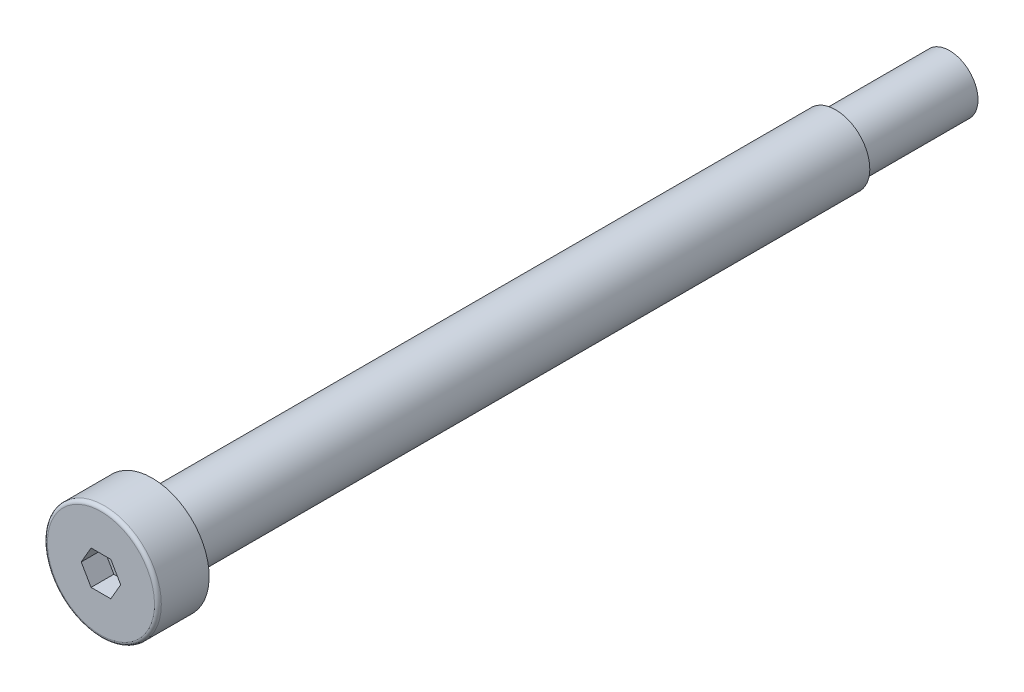
ISO-10303-21;
HEADER;
FILE_DESCRIPTION(('STEP AP214'),'2;1');
FILE_NAME('part.step','',(''),(''),'','','');
FILE_SCHEMA(('AUTOMOTIVE_DESIGN { 1 0 10303 214 1 1 1 1 }'));
ENDSEC;
DATA;
#1=APPLICATION_CONTEXT('core data for automotive mechanical design processes');
#2=APPLICATION_PROTOCOL_DEFINITION('international standard','automotive_design',2000,#1);
#3=PRODUCT_CONTEXT('',#1,'mechanical');
#4=PRODUCT('Part','Part','',(#3));
#5=PRODUCT_RELATED_PRODUCT_CATEGORY('part','',(#4));
#6=PRODUCT_DEFINITION_FORMATION('','',#4);
#7=PRODUCT_DEFINITION_CONTEXT('part definition',#1,'design');
#8=PRODUCT_DEFINITION('design','',#6,#7);
#9=PRODUCT_DEFINITION_SHAPE('','',#8);
#10=(LENGTH_UNIT() NAMED_UNIT(*) SI_UNIT(.MILLI.,.METRE.));
#11=(NAMED_UNIT(*) PLANE_ANGLE_UNIT() SI_UNIT($,.RADIAN.));
#12=(NAMED_UNIT(*) SI_UNIT($,.STERADIAN.) SOLID_ANGLE_UNIT());
#13=UNCERTAINTY_MEASURE_WITH_UNIT(LENGTH_MEASURE(1.E-05),#10,'distance_accuracy_value','');
#14=(GEOMETRIC_REPRESENTATION_CONTEXT(3) GLOBAL_UNCERTAINTY_ASSIGNED_CONTEXT((#13)) GLOBAL_UNIT_ASSIGNED_CONTEXT((#10,
#11,#12)) REPRESENTATION_CONTEXT('',''));
#15=CARTESIAN_POINT('',(0.,0.,0.));
#16=DIRECTION('',(0.,0.,1.));
#17=DIRECTION('',(1.,0.,0.));
#18=AXIS2_PLACEMENT_3D('',#15,#16,#17);
#19=CARTESIAN_POINT('',(0.,0.,0.));
#20=DIRECTION('',(0.,0.,1.));
#21=DIRECTION('',(0.,-1.,0.));
#22=AXIS2_PLACEMENT_3D('',#19,#20,#21);
#23=PLANE('',#22);
#24=CARTESIAN_POINT('',(0.,0.,0.));
#25=DIRECTION('',(0.,0.,1.));
#26=DIRECTION('',(0.,-1.,0.));
#27=AXIS2_PLACEMENT_3D('',#24,#25,#26);
#28=CIRCLE('',#27,4.7);
#29=CARTESIAN_POINT('',(0.,-4.7,0.));
#30=VERTEX_POINT('',#29);
#31=EDGE_CURVE('E11',#30,#30,#28,.T.);
#32=ORIENTED_EDGE('',*,*,#31,.T.);
#33=EDGE_LOOP('',(#32));
#34=FACE_BOUND('',#33,.T.);
#35=DIRECTION('',(-0.5,0.866025403784438,0.));
#36=VECTOR('',#35,1.);
#37=CARTESIAN_POINT('',(1.73205080756888,0.,0.));
#38=LINE('',#37,#36);
#39=CARTESIAN_POINT('',(1.73205080756888,0.,0.));
#40=VERTEX_POINT('',#39);
#41=CARTESIAN_POINT('',(0.866025403784439,1.5,0.));
#42=VERTEX_POINT('',#41);
#43=EDGE_CURVE('E51',#40,#42,#38,.T.);
#44=ORIENTED_EDGE('',*,*,#43,.F.);
#45=DIRECTION('',(0.5,0.866025403784439,0.));
#46=VECTOR('',#45,1.);
#47=CARTESIAN_POINT('',(0.866025403784438,-1.5,0.));
#48=LINE('',#47,#46);
#49=CARTESIAN_POINT('',(0.866025403784438,-1.5,0.));
#50=VERTEX_POINT('',#49);
#51=EDGE_CURVE('E134',#50,#40,#48,.T.);
#52=ORIENTED_EDGE('',*,*,#51,.F.);
#53=DIRECTION('',(1.,0.,0.));
#54=VECTOR('',#53,1.);
#55=CARTESIAN_POINT('',(-0.866025403784438,-1.5,0.));
#56=LINE('',#55,#54);
#57=CARTESIAN_POINT('',(-0.866025403784438,-1.5,0.));
#58=VERTEX_POINT('',#57);
#59=EDGE_CURVE('E132',#58,#50,#56,.T.);
#60=ORIENTED_EDGE('',*,*,#59,.F.);
#61=DIRECTION('',(0.5,-0.866025403784438,0.));
#62=VECTOR('',#61,1.);
#63=CARTESIAN_POINT('',(-1.73205080756888,0.,0.));
#64=LINE('',#63,#62);
#65=CARTESIAN_POINT('',(-1.73205080756888,0.,0.));
#66=VERTEX_POINT('',#65);
#67=EDGE_CURVE('E99',#66,#58,#64,.T.);
#68=ORIENTED_EDGE('',*,*,#67,.F.);
#69=DIRECTION('',(-0.5,-0.866025403784438,0.));
#70=VECTOR('',#69,1.);
#71=CARTESIAN_POINT('',(-0.866025403784439,1.5,0.));
#72=LINE('',#71,#70);
#73=CARTESIAN_POINT('',(-0.866025403784439,1.5,0.));
#74=VERTEX_POINT('',#73);
#75=EDGE_CURVE('E128',#74,#66,#72,.T.);
#76=ORIENTED_EDGE('',*,*,#75,.F.);
#77=DIRECTION('',(-1.,0.,0.));
#78=VECTOR('',#77,1.);
#79=CARTESIAN_POINT('',(0.866025403784439,1.5,0.));
#80=LINE('',#79,#78);
#81=EDGE_CURVE('E125',#42,#74,#80,.T.);
#82=ORIENTED_EDGE('',*,*,#81,.F.);
#83=EDGE_LOOP('',(#44,#52,#60,#68,#76,#82));
#84=FACE_BOUND('',#83,.T.);
#85=ADVANCED_FACE('F36',(#34,#84),#23,.T.);
#86=CARTESIAN_POINT('',(0.,0.,-74.5));
#87=DIRECTION('',(0.,0.,-1.));
#88=DIRECTION('',(0.,1.,0.));
#89=AXIS2_PLACEMENT_3D('',#86,#87,#88);
#90=CYLINDRICAL_SURFACE('',#89,5.);
#91=CARTESIAN_POINT('',(0.,0.,-0.299999999999995));
#92=DIRECTION('',(0.,0.,1.));
#93=DIRECTION('',(0.,-1.,0.));
#94=AXIS2_PLACEMENT_3D('',#91,#92,#93);
#95=CIRCLE('',#94,5.);
#96=CARTESIAN_POINT('',(0.,-5.,-0.299999999999996));
#97=VERTEX_POINT('',#96);
#98=EDGE_CURVE('E44',#97,#97,#95,.F.);
#99=ORIENTED_EDGE('',*,*,#98,.T.);
#100=EDGE_LOOP('',(#99));
#101=FACE_BOUND('',#100,.T.);
#102=CARTESIAN_POINT('',(0.,0.,-4.5));
#103=DIRECTION('',(0.,0.,-1.));
#104=DIRECTION('',(0.,1.,0.));
#105=AXIS2_PLACEMENT_3D('',#102,#103,#104);
#106=CIRCLE('',#105,5.);
#107=CARTESIAN_POINT('',(0.,5.,-4.5));
#108=VERTEX_POINT('',#107);
#109=EDGE_CURVE('E155',#108,#108,#106,.T.);
#110=ORIENTED_EDGE('',*,*,#109,.F.);
#111=EDGE_LOOP('',(#110));
#112=FACE_BOUND('',#111,.T.);
#113=ADVANCED_FACE('F160',(#101,#112),#90,.T.);
#114=CARTESIAN_POINT('',(0.,5.,-4.5));
#115=DIRECTION('',(0.,0.,-1.));
#116=DIRECTION('',(0.,1.,0.));
#117=AXIS2_PLACEMENT_3D('',#114,#115,#116);
#118=PLANE('',#117);
#119=ORIENTED_EDGE('',*,*,#109,.T.);
#120=EDGE_LOOP('',(#119));
#121=FACE_BOUND('',#120,.T.);
#122=CARTESIAN_POINT('',(0.,0.,-4.5));
#123=DIRECTION('',(0.,0.,-1.));
#124=DIRECTION('',(0.,1.,0.));
#125=AXIS2_PLACEMENT_3D('',#122,#123,#124);
#126=CIRCLE('',#125,3.);
#127=CARTESIAN_POINT('',(0.,3.,-4.5));
#128=VERTEX_POINT('',#127);
#129=EDGE_CURVE('E152',#128,#128,#126,.T.);
#130=ORIENTED_EDGE('',*,*,#129,.F.);
#131=EDGE_LOOP('',(#130));
#132=FACE_BOUND('',#131,.T.);
#133=ADVANCED_FACE('F176',(#121,#132),#118,.T.);
#134=CARTESIAN_POINT('',(0.,0.,-74.5));
#135=DIRECTION('',(0.,0.,-1.));
#136=DIRECTION('',(0.,1.,0.));
#137=AXIS2_PLACEMENT_3D('',#134,#135,#136);
#138=CYLINDRICAL_SURFACE('',#137,2.99999999999999);
#139=ORIENTED_EDGE('',*,*,#129,.T.);
#140=EDGE_LOOP('',(#139));
#141=FACE_BOUND('',#140,.T.);
#142=CARTESIAN_POINT('',(0.,0.,-64.5));
#143=DIRECTION('',(0.,0.,-1.));
#144=DIRECTION('',(0.,1.,0.));
#145=AXIS2_PLACEMENT_3D('',#142,#143,#144);
#146=CIRCLE('',#145,2.99999999999998);
#147=CARTESIAN_POINT('',(0.,3.,-64.5));
#148=VERTEX_POINT('',#147);
#149=EDGE_CURVE('E149',#148,#148,#146,.T.);
#150=ORIENTED_EDGE('',*,*,#149,.F.);
#151=EDGE_LOOP('',(#150));
#152=FACE_BOUND('',#151,.T.);
#153=ADVANCED_FACE('F182',(#141,#152),#138,.T.);
#154=CARTESIAN_POINT('',(0.,3.,-64.5));
#155=DIRECTION('',(0.,0.,-1.));
#156=DIRECTION('',(0.,1.,0.));
#157=AXIS2_PLACEMENT_3D('',#154,#155,#156);
#158=PLANE('',#157);
#159=ORIENTED_EDGE('',*,*,#149,.T.);
#160=EDGE_LOOP('',(#159));
#161=FACE_BOUND('',#160,.T.);
#162=CARTESIAN_POINT('',(0.,0.,-64.5));
#163=DIRECTION('',(0.,0.,-1.));
#164=DIRECTION('',(0.,1.,0.));
#165=AXIS2_PLACEMENT_3D('',#162,#163,#164);
#166=CIRCLE('',#165,2.49999999999999);
#167=CARTESIAN_POINT('',(0.,2.5,-64.5));
#168=VERTEX_POINT('',#167);
#169=EDGE_CURVE('E146',#168,#168,#166,.T.);
#170=ORIENTED_EDGE('',*,*,#169,.F.);
#171=EDGE_LOOP('',(#170));
#172=FACE_BOUND('',#171,.T.);
#173=ADVANCED_FACE('F186',(#161,#172),#158,.T.);
#174=CARTESIAN_POINT('',(0.,0.,-74.5));
#175=DIRECTION('',(0.,0.,-1.));
#176=DIRECTION('',(0.,1.,0.));
#177=AXIS2_PLACEMENT_3D('',#174,#175,#176);
#178=CYLINDRICAL_SURFACE('',#177,2.49999999999998);
#179=ORIENTED_EDGE('',*,*,#169,.T.);
#180=EDGE_LOOP('',(#179));
#181=FACE_BOUND('',#180,.T.);
#182=CARTESIAN_POINT('',(0.,0.,-74.5));
#183=DIRECTION('',(0.,0.,-1.));
#184=DIRECTION('',(0.,1.,0.));
#185=AXIS2_PLACEMENT_3D('',#182,#183,#184);
#186=CIRCLE('',#185,2.49999999999998);
#187=CARTESIAN_POINT('',(0.,2.5,-74.5));
#188=VERTEX_POINT('',#187);
#189=EDGE_CURVE('E138',#188,#188,#186,.T.);
#190=ORIENTED_EDGE('',*,*,#189,.F.);
#191=EDGE_LOOP('',(#190));
#192=FACE_BOUND('',#191,.T.);
#193=ADVANCED_FACE('F190',(#181,#192),#178,.T.);
#194=CARTESIAN_POINT('',(0.,2.5,-74.5));
#195=DIRECTION('',(0.,0.,-1.));
#196=DIRECTION('',(0.,1.,0.));
#197=AXIS2_PLACEMENT_3D('',#194,#195,#196);
#198=PLANE('',#197);
#199=ORIENTED_EDGE('',*,*,#189,.T.);
#200=EDGE_LOOP('',(#199));
#201=FACE_BOUND('',#200,.T.);
#202=ADVANCED_FACE('F194',(#201),#198,.T.);
#203=CARTESIAN_POINT('',(1.73205080756888,0.,-2.));
#204=DIRECTION('',(0.866025403784438,0.5,0.));
#205=DIRECTION('',(-0.5,0.866025403784439,0.));
#206=AXIS2_PLACEMENT_3D('',#203,#204,#205);
#207=PLANE('',#206);
#208=ORIENTED_EDGE('',*,*,#43,.T.);
#209=DIRECTION('',(0.,0.,1.));
#210=VECTOR('',#209,1.);
#211=CARTESIAN_POINT('',(0.866025403784439,1.5,-2.));
#212=LINE('',#211,#210);
#213=CARTESIAN_POINT('',(0.866025403784439,1.5,-2.));
#214=VERTEX_POINT('',#213);
#215=EDGE_CURVE('E81',#214,#42,#212,.T.);
#216=ORIENTED_EDGE('',*,*,#215,.F.);
#217=DIRECTION('',(-0.5,0.866025403784438,0.));
#218=VECTOR('',#217,1.);
#219=CARTESIAN_POINT('',(1.73205080756888,0.,-2.));
#220=LINE('',#219,#218);
#221=CARTESIAN_POINT('',(1.73205080756888,0.,-2.));
#222=VERTEX_POINT('',#221);
#223=EDGE_CURVE('E136',#222,#214,#220,.T.);
#224=ORIENTED_EDGE('',*,*,#223,.F.);
#225=DIRECTION('',(0.,0.,1.));
#226=VECTOR('',#225,1.);
#227=CARTESIAN_POINT('',(1.73205080756888,0.,-2.));
#228=LINE('',#227,#226);
#229=EDGE_CURVE('E59',#222,#40,#228,.T.);
#230=ORIENTED_EDGE('',*,*,#229,.T.);
#231=EDGE_LOOP('',(#208,#216,#224,#230));
#232=FACE_BOUND('',#231,.T.);
#233=ADVANCED_FACE('F198',(#232),#207,.F.);
#234=CARTESIAN_POINT('',(0.866025403784438,-1.5,-2.));
#235=DIRECTION('',(0.866025403784439,-0.5,0.));
#236=DIRECTION('',(0.5,0.866025403784439,0.));
#237=AXIS2_PLACEMENT_3D('',#234,#235,#236);
#238=PLANE('',#237);
#239=ORIENTED_EDGE('',*,*,#51,.T.);
#240=ORIENTED_EDGE('',*,*,#229,.F.);
#241=DIRECTION('',(0.5,0.866025403784439,0.));
#242=VECTOR('',#241,1.);
#243=CARTESIAN_POINT('',(0.866025403784438,-1.5,-2.));
#244=LINE('',#243,#242);
#245=CARTESIAN_POINT('',(0.866025403784438,-1.5,-2.));
#246=VERTEX_POINT('',#245);
#247=EDGE_CURVE('E111',#246,#222,#244,.T.);
#248=ORIENTED_EDGE('',*,*,#247,.F.);
#249=DIRECTION('',(0.,0.,1.));
#250=VECTOR('',#249,1.);
#251=CARTESIAN_POINT('',(0.866025403784438,-1.5,-2.));
#252=LINE('',#251,#250);
#253=EDGE_CURVE('E103',#246,#50,#252,.T.);
#254=ORIENTED_EDGE('',*,*,#253,.T.);
#255=EDGE_LOOP('',(#239,#240,#248,#254));
#256=FACE_BOUND('',#255,.T.);
#257=ADVANCED_FACE('F202',(#256),#238,.F.);
#258=CARTESIAN_POINT('',(-0.866025403784438,-1.5,-2.));
#259=DIRECTION('',(0.,-1.,0.));
#260=DIRECTION('',(0.,0.,-1.));
#261=AXIS2_PLACEMENT_3D('',#258,#259,#260);
#262=PLANE('',#261);
#263=ORIENTED_EDGE('',*,*,#59,.T.);
#264=ORIENTED_EDGE('',*,*,#253,.F.);
#265=DIRECTION('',(1.,0.,0.));
#266=VECTOR('',#265,1.);
#267=CARTESIAN_POINT('',(-0.866025403784438,-1.5,-2.));
#268=LINE('',#267,#266);
#269=CARTESIAN_POINT('',(-0.866025403784438,-1.5,-2.));
#270=VERTEX_POINT('',#269);
#271=EDGE_CURVE('E107',#270,#246,#268,.T.);
#272=ORIENTED_EDGE('',*,*,#271,.F.);
#273=DIRECTION('',(0.,0.,1.));
#274=VECTOR('',#273,1.);
#275=CARTESIAN_POINT('',(-0.866025403784438,-1.5,-2.));
#276=LINE('',#275,#274);
#277=EDGE_CURVE('E92',#270,#58,#276,.T.);
#278=ORIENTED_EDGE('',*,*,#277,.T.);
#279=EDGE_LOOP('',(#263,#264,#272,#278));
#280=FACE_BOUND('',#279,.T.);
#281=ADVANCED_FACE('F108',(#280),#262,.F.);
#282=CARTESIAN_POINT('',(-1.73205080756888,0.,-2.));
#283=DIRECTION('',(-0.866025403784438,-0.5,0.));
#284=DIRECTION('',(0.5,-0.866025403784439,0.));
#285=AXIS2_PLACEMENT_3D('',#282,#283,#284);
#286=PLANE('',#285);
#287=ORIENTED_EDGE('',*,*,#67,.T.);
#288=ORIENTED_EDGE('',*,*,#277,.F.);
#289=DIRECTION('',(0.5,-0.866025403784438,0.));
#290=VECTOR('',#289,1.);
#291=CARTESIAN_POINT('',(-1.73205080756888,0.,-2.));
#292=LINE('',#291,#290);
#293=CARTESIAN_POINT('',(-1.73205080756888,0.,-2.));
#294=VERTEX_POINT('',#293);
#295=EDGE_CURVE('E96',#294,#270,#292,.T.);
#296=ORIENTED_EDGE('',*,*,#295,.F.);
#297=DIRECTION('',(0.,0.,1.));
#298=VECTOR('',#297,1.);
#299=CARTESIAN_POINT('',(-1.73205080756888,0.,-2.));
#300=LINE('',#299,#298);
#301=EDGE_CURVE('E104',#294,#66,#300,.T.);
#302=ORIENTED_EDGE('',*,*,#301,.T.);
#303=EDGE_LOOP('',(#287,#288,#296,#302));
#304=FACE_BOUND('',#303,.T.);
#305=ADVANCED_FACE('F94',(#304),#286,.F.);
#306=CARTESIAN_POINT('',(-0.866025403784439,1.5,-2.));
#307=DIRECTION('',(-0.866025403784439,0.5,0.));
#308=DIRECTION('',(-0.5,-0.866025403784438,0.));
#309=AXIS2_PLACEMENT_3D('',#306,#307,#308);
#310=PLANE('',#309);
#311=ORIENTED_EDGE('',*,*,#75,.T.);
#312=ORIENTED_EDGE('',*,*,#301,.F.);
#313=DIRECTION('',(-0.5,-0.866025403784438,0.));
#314=VECTOR('',#313,1.);
#315=CARTESIAN_POINT('',(-0.866025403784439,1.5,-2.));
#316=LINE('',#315,#314);
#317=CARTESIAN_POINT('',(-0.866025403784439,1.5,-2.));
#318=VERTEX_POINT('',#317);
#319=EDGE_CURVE('E117',#318,#294,#316,.T.);
#320=ORIENTED_EDGE('',*,*,#319,.F.);
#321=DIRECTION('',(0.,0.,1.));
#322=VECTOR('',#321,1.);
#323=CARTESIAN_POINT('',(-0.866025403784439,1.5,-2.));
#324=LINE('',#323,#322);
#325=EDGE_CURVE('E141',#318,#74,#324,.T.);
#326=ORIENTED_EDGE('',*,*,#325,.T.);
#327=EDGE_LOOP('',(#311,#312,#320,#326));
#328=FACE_BOUND('',#327,.T.);
#329=ADVANCED_FACE('F205',(#328),#310,.F.);
#330=CARTESIAN_POINT('',(0.866025403784439,1.5,-2.));
#331=DIRECTION('',(0.,1.,0.));
#332=DIRECTION('',(-1.,0.,0.));
#333=AXIS2_PLACEMENT_3D('',#330,#331,#332);
#334=PLANE('',#333);
#335=ORIENTED_EDGE('',*,*,#81,.T.);
#336=ORIENTED_EDGE('',*,*,#325,.F.);
#337=DIRECTION('',(-1.,0.,0.));
#338=VECTOR('',#337,1.);
#339=CARTESIAN_POINT('',(0.866025403784439,1.5,-2.));
#340=LINE('',#339,#338);
#341=EDGE_CURVE('E119',#214,#318,#340,.T.);
#342=ORIENTED_EDGE('',*,*,#341,.F.);
#343=ORIENTED_EDGE('',*,*,#215,.T.);
#344=EDGE_LOOP('',(#335,#336,#342,#343));
#345=FACE_BOUND('',#344,.T.);
#346=ADVANCED_FACE('F168',(#345),#334,.F.);
#347=CARTESIAN_POINT('',(0.,0.,-2.));
#348=DIRECTION('',(0.,0.,1.));
#349=DIRECTION('',(1.,0.,0.));
#350=AXIS2_PLACEMENT_3D('',#347,#348,#349);
#351=PLANE('',#350);
#352=ORIENTED_EDGE('',*,*,#223,.T.);
#353=ORIENTED_EDGE('',*,*,#341,.T.);
#354=ORIENTED_EDGE('',*,*,#319,.T.);
#355=ORIENTED_EDGE('',*,*,#295,.T.);
#356=ORIENTED_EDGE('',*,*,#271,.T.);
#357=ORIENTED_EDGE('',*,*,#247,.T.);
#358=EDGE_LOOP('',(#352,#353,#354,#355,#356,#357));
#359=FACE_BOUND('',#358,.T.);
#360=ADVANCED_FACE('F114',(#359),#351,.T.);
#361=CARTESIAN_POINT('',(0.,0.,-0.299999999999995));
#362=DIRECTION('',(0.,0.,1.));
#363=DIRECTION('',(0.,-1.,0.));
#364=AXIS2_PLACEMENT_3D('',#361,#362,#363);
#365=TOROIDAL_SURFACE('',#364,4.7,0.3);
#366=ORIENTED_EDGE('',*,*,#31,.F.);
#367=EDGE_LOOP('',(#366));
#368=FACE_BOUND('',#367,.T.);
#369=ORIENTED_EDGE('',*,*,#98,.F.);
#370=EDGE_LOOP('',(#369));
#371=FACE_BOUND('',#370,.T.);
#372=ADVANCED_FACE('F38',(#368,#371),#365,.T.);
#373=CLOSED_SHELL('',(#85,#113,#133,#153,#173,#193,#202,#233,#257,#281,#305,#329,#346,#360,#372));
#374=MANIFOLD_SOLID_BREP('B2',#373);
#375=ADVANCED_BREP_SHAPE_REPRESENTATION('',(#18,#374),#14);
#376=SHAPE_DEFINITION_REPRESENTATION(#9,#375);
ENDSEC;
END-ISO-10303-21;
